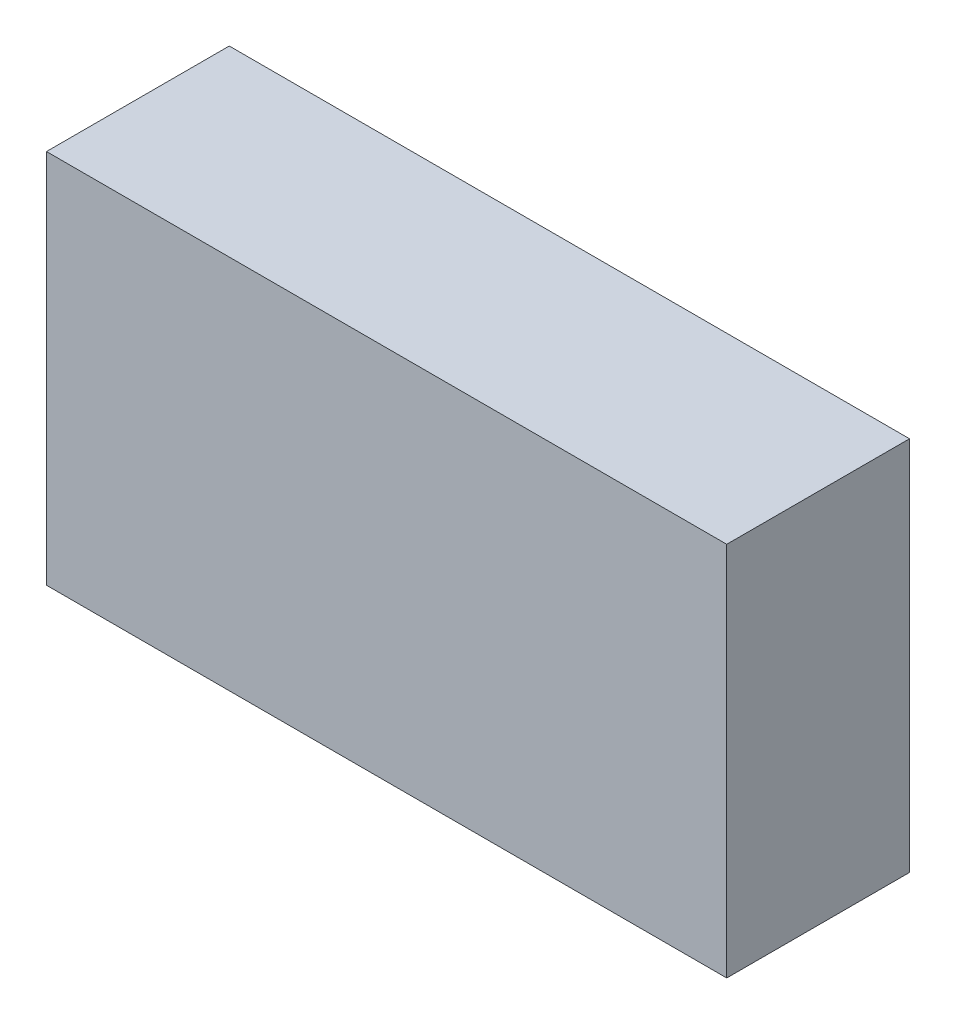
ISO-10303-21;
HEADER;
FILE_DESCRIPTION(('STEP AP214'),'2;1');
FILE_NAME('part.step','',(''),(''),'','','');
FILE_SCHEMA(('AUTOMOTIVE_DESIGN { 1 0 10303 214 1 1 1 1 }'));
ENDSEC;
DATA;
#1=APPLICATION_CONTEXT('core data for automotive mechanical design processes');
#2=APPLICATION_PROTOCOL_DEFINITION('international standard','automotive_design',2000,#1);
#3=PRODUCT_CONTEXT('',#1,'mechanical');
#4=PRODUCT('Part','Part','',(#3));
#5=PRODUCT_RELATED_PRODUCT_CATEGORY('part','',(#4));
#6=PRODUCT_DEFINITION_FORMATION('','',#4);
#7=PRODUCT_DEFINITION_CONTEXT('part definition',#1,'design');
#8=PRODUCT_DEFINITION('design','',#6,#7);
#9=PRODUCT_DEFINITION_SHAPE('','',#8);
#10=(LENGTH_UNIT() NAMED_UNIT(*) SI_UNIT(.MILLI.,.METRE.));
#11=(NAMED_UNIT(*) PLANE_ANGLE_UNIT() SI_UNIT($,.RADIAN.));
#12=(NAMED_UNIT(*) SI_UNIT($,.STERADIAN.) SOLID_ANGLE_UNIT());
#13=UNCERTAINTY_MEASURE_WITH_UNIT(LENGTH_MEASURE(1.E-05),#10,'distance_accuracy_value','');
#14=(GEOMETRIC_REPRESENTATION_CONTEXT(3) GLOBAL_UNCERTAINTY_ASSIGNED_CONTEXT((#13)) GLOBAL_UNIT_ASSIGNED_CONTEXT((#10,
#11,#12)) REPRESENTATION_CONTEXT('',''));
#15=CARTESIAN_POINT('',(0.,0.,0.));
#16=DIRECTION('',(0.,0.,1.));
#17=DIRECTION('',(1.,0.,0.));
#18=AXIS2_PLACEMENT_3D('',#15,#16,#17);
#19=CARTESIAN_POINT('',(-3.34949292,1.84949084,1.79999894));
#20=DIRECTION('',(0.,0.,-1.));
#21=DIRECTION('',(0.,-1.,0.));
#22=AXIS2_PLACEMENT_3D('',#19,#20,#21);
#23=PLANE('',#22);
#24=DIRECTION('',(0.,-1.,0.));
#25=VECTOR('',#24,1.);
#26=CARTESIAN_POINT('',(-3.34949292,1.84949084,1.79999894));
#27=LINE('',#26,#25);
#28=CARTESIAN_POINT('',(-3.34949292,1.84949084,1.79999894));
#29=VERTEX_POINT('',#28);
#30=CARTESIAN_POINT('',(-3.34949292,-1.84949084,1.79999894));
#31=VERTEX_POINT('',#30);
#32=EDGE_CURVE('E82',#29,#31,#27,.T.);
#33=ORIENTED_EDGE('',*,*,#32,.T.);
#34=DIRECTION('',(1.,0.,0.));
#35=VECTOR('',#34,1.);
#36=CARTESIAN_POINT('',(-3.34949292,-1.84949084,1.79999894));
#37=LINE('',#36,#35);
#38=CARTESIAN_POINT('',(3.34949292,-1.84949084,1.79999894));
#39=VERTEX_POINT('',#38);
#40=EDGE_CURVE('E106',#31,#39,#37,.T.);
#41=ORIENTED_EDGE('',*,*,#40,.T.);
#42=DIRECTION('',(0.,1.,0.));
#43=VECTOR('',#42,1.);
#44=CARTESIAN_POINT('',(3.34949292,-1.84949084,1.79999894));
#45=LINE('',#44,#43);
#46=CARTESIAN_POINT('',(3.34949292,1.84949084,1.79999894));
#47=VERTEX_POINT('',#46);
#48=EDGE_CURVE('E75',#39,#47,#45,.T.);
#49=ORIENTED_EDGE('',*,*,#48,.T.);
#50=DIRECTION('',(-1.,0.,0.));
#51=VECTOR('',#50,1.);
#52=CARTESIAN_POINT('',(3.34949292,1.84949084,1.79999894));
#53=LINE('',#52,#51);
#54=EDGE_CURVE('E11',#47,#29,#53,.T.);
#55=ORIENTED_EDGE('',*,*,#54,.T.);
#56=EDGE_LOOP('',(#33,#41,#49,#55));
#57=FACE_BOUND('',#56,.T.);
#58=ADVANCED_FACE('F17',(#57),#23,.F.);
#59=CARTESIAN_POINT('',(-3.34949292,1.84949084,0.));
#60=DIRECTION('',(0.,0.,-1.));
#61=DIRECTION('',(0.,-1.,0.));
#62=AXIS2_PLACEMENT_3D('',#59,#60,#61);
#63=PLANE('',#62);
#64=DIRECTION('',(-1.,0.,0.));
#65=VECTOR('',#64,1.);
#66=CARTESIAN_POINT('',(3.34949292,1.84949084,0.));
#67=LINE('',#66,#65);
#68=CARTESIAN_POINT('',(3.34949292,1.84949084,0.));
#69=VERTEX_POINT('',#68);
#70=CARTESIAN_POINT('',(-3.34949292,1.84949084,0.));
#71=VERTEX_POINT('',#70);
#72=EDGE_CURVE('E20',#69,#71,#67,.T.);
#73=ORIENTED_EDGE('',*,*,#72,.F.);
#74=DIRECTION('',(0.,1.,0.));
#75=VECTOR('',#74,1.);
#76=CARTESIAN_POINT('',(3.34949292,-1.84949084,0.));
#77=LINE('',#76,#75);
#78=CARTESIAN_POINT('',(3.34949292,-1.84949084,0.));
#79=VERTEX_POINT('',#78);
#80=EDGE_CURVE('E109',#79,#69,#77,.T.);
#81=ORIENTED_EDGE('',*,*,#80,.F.);
#82=DIRECTION('',(1.,0.,0.));
#83=VECTOR('',#82,1.);
#84=CARTESIAN_POINT('',(-3.34949292,-1.84949084,0.));
#85=LINE('',#84,#83);
#86=CARTESIAN_POINT('',(-3.34949292,-1.84949084,0.));
#87=VERTEX_POINT('',#86);
#88=EDGE_CURVE('E84',#87,#79,#85,.T.);
#89=ORIENTED_EDGE('',*,*,#88,.F.);
#90=DIRECTION('',(0.,-1.,0.));
#91=VECTOR('',#90,1.);
#92=CARTESIAN_POINT('',(-3.34949292,1.84949084,0.));
#93=LINE('',#92,#91);
#94=EDGE_CURVE('E80',#71,#87,#93,.T.);
#95=ORIENTED_EDGE('',*,*,#94,.F.);
#96=EDGE_LOOP('',(#73,#81,#89,#95));
#97=FACE_BOUND('',#96,.T.);
#98=ADVANCED_FACE('F86',(#97),#63,.T.);
#99=CARTESIAN_POINT('',(3.34949292,1.84949084,0.));
#100=DIRECTION('',(0.,-1.,0.));
#101=DIRECTION('',(0.,0.,-1.));
#102=AXIS2_PLACEMENT_3D('',#99,#100,#101);
#103=PLANE('',#102);
#104=ORIENTED_EDGE('',*,*,#72,.T.);
#105=DIRECTION('',(0.,0.,1.));
#106=VECTOR('',#105,1.);
#107=CARTESIAN_POINT('',(-3.34949292,1.84949084,0.));
#108=LINE('',#107,#106);
#109=EDGE_CURVE('E69',#71,#29,#108,.T.);
#110=ORIENTED_EDGE('',*,*,#109,.T.);
#111=ORIENTED_EDGE('',*,*,#54,.F.);
#112=DIRECTION('',(0.,0.,1.));
#113=VECTOR('',#112,1.);
#114=CARTESIAN_POINT('',(3.34949292,1.84949084,0.));
#115=LINE('',#114,#113);
#116=EDGE_CURVE('E72',#69,#47,#115,.T.);
#117=ORIENTED_EDGE('',*,*,#116,.F.);
#118=EDGE_LOOP('',(#104,#110,#111,#117));
#119=FACE_BOUND('',#118,.T.);
#120=ADVANCED_FACE('F68',(#119),#103,.F.);
#121=CARTESIAN_POINT('',(3.34949292,-1.84949084,0.));
#122=DIRECTION('',(-1.,0.,0.));
#123=DIRECTION('',(0.,0.,1.));
#124=AXIS2_PLACEMENT_3D('',#121,#122,#123);
#125=PLANE('',#124);
#126=ORIENTED_EDGE('',*,*,#80,.T.);
#127=ORIENTED_EDGE('',*,*,#116,.T.);
#128=ORIENTED_EDGE('',*,*,#48,.F.);
#129=DIRECTION('',(0.,0.,1.));
#130=VECTOR('',#129,1.);
#131=CARTESIAN_POINT('',(3.34949292,-1.84949084,0.));
#132=LINE('',#131,#130);
#133=EDGE_CURVE('E102',#79,#39,#132,.T.);
#134=ORIENTED_EDGE('',*,*,#133,.F.);
#135=EDGE_LOOP('',(#126,#127,#128,#134));
#136=FACE_BOUND('',#135,.T.);
#137=ADVANCED_FACE('F120',(#136),#125,.F.);
#138=CARTESIAN_POINT('',(-3.34949292,-1.84949084,0.));
#139=DIRECTION('',(0.,1.,0.));
#140=DIRECTION('',(1.,0.,0.));
#141=AXIS2_PLACEMENT_3D('',#138,#139,#140);
#142=PLANE('',#141);
#143=ORIENTED_EDGE('',*,*,#88,.T.);
#144=ORIENTED_EDGE('',*,*,#133,.T.);
#145=ORIENTED_EDGE('',*,*,#40,.F.);
#146=DIRECTION('',(0.,0.,1.));
#147=VECTOR('',#146,1.);
#148=CARTESIAN_POINT('',(-3.34949292,-1.84949084,0.));
#149=LINE('',#148,#147);
#150=EDGE_CURVE('E90',#87,#31,#149,.T.);
#151=ORIENTED_EDGE('',*,*,#150,.F.);
#152=EDGE_LOOP('',(#143,#144,#145,#151));
#153=FACE_BOUND('',#152,.T.);
#154=ADVANCED_FACE('F122',(#153),#142,.F.);
#155=CARTESIAN_POINT('',(-3.34949292,1.84949084,0.));
#156=DIRECTION('',(1.,0.,0.));
#157=DIRECTION('',(0.,1.,0.));
#158=AXIS2_PLACEMENT_3D('',#155,#156,#157);
#159=PLANE('',#158);
#160=ORIENTED_EDGE('',*,*,#94,.T.);
#161=ORIENTED_EDGE('',*,*,#150,.T.);
#162=ORIENTED_EDGE('',*,*,#32,.F.);
#163=ORIENTED_EDGE('',*,*,#109,.F.);
#164=EDGE_LOOP('',(#160,#161,#162,#163));
#165=FACE_BOUND('',#164,.T.);
#166=ADVANCED_FACE('F78',(#165),#159,.F.);
#167=CLOSED_SHELL('',(#58,#98,#120,#137,#154,#166));
#168=MANIFOLD_SOLID_BREP('B1',#167);
#169=ADVANCED_BREP_SHAPE_REPRESENTATION('',(#18,#168),#14);
#170=SHAPE_DEFINITION_REPRESENTATION(#9,#169);
ENDSEC;
END-ISO-10303-21;
